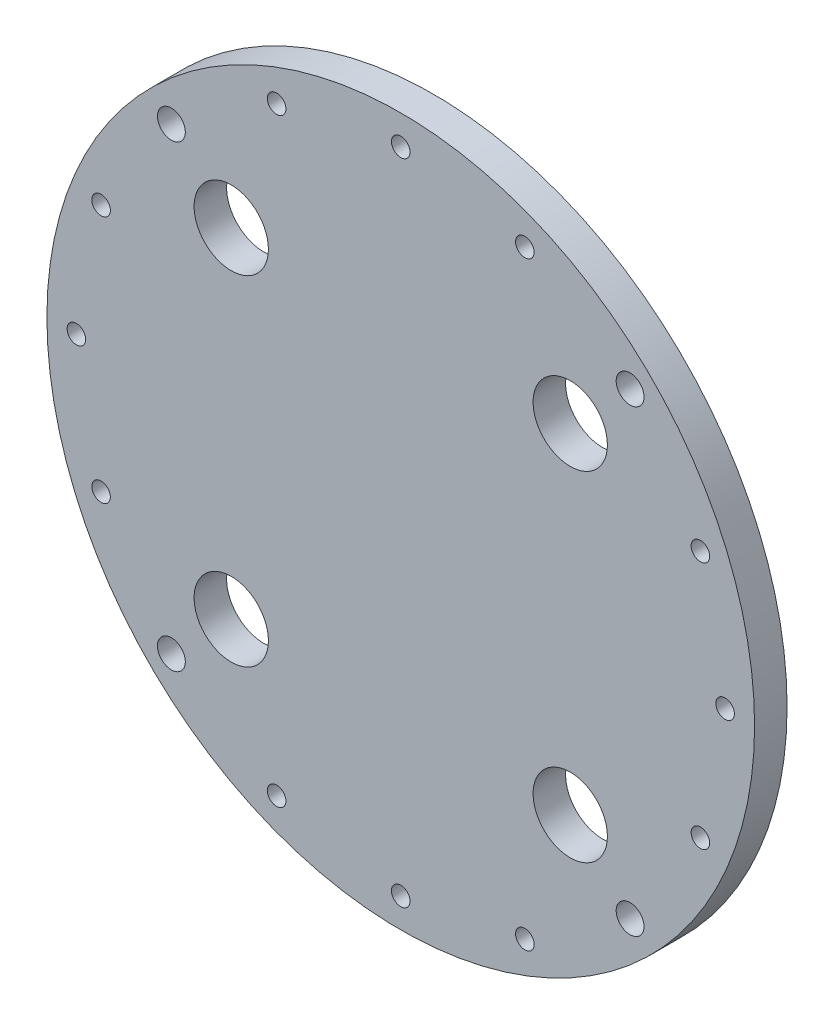
ISO-10303-21;
HEADER;
FILE_DESCRIPTION(('STEP AP214'),'2;1');
FILE_NAME('part.step','',(''),(''),'','','');
FILE_SCHEMA(('AUTOMOTIVE_DESIGN { 1 0 10303 214 1 1 1 1 }'));
ENDSEC;
DATA;
#1=APPLICATION_CONTEXT('core data for automotive mechanical design processes');
#2=APPLICATION_PROTOCOL_DEFINITION('international standard','automotive_design',2000,#1);
#3=PRODUCT_CONTEXT('',#1,'mechanical');
#4=PRODUCT('Part','Part','',(#3));
#5=PRODUCT_RELATED_PRODUCT_CATEGORY('part','',(#4));
#6=PRODUCT_DEFINITION_FORMATION('','',#4);
#7=PRODUCT_DEFINITION_CONTEXT('part definition',#1,'design');
#8=PRODUCT_DEFINITION('design','',#6,#7);
#9=PRODUCT_DEFINITION_SHAPE('','',#8);
#10=(LENGTH_UNIT() NAMED_UNIT(*) SI_UNIT(.MILLI.,.METRE.));
#11=(NAMED_UNIT(*) PLANE_ANGLE_UNIT() SI_UNIT($,.RADIAN.));
#12=(NAMED_UNIT(*) SI_UNIT($,.STERADIAN.) SOLID_ANGLE_UNIT());
#13=UNCERTAINTY_MEASURE_WITH_UNIT(LENGTH_MEASURE(1.E-05),#10,'distance_accuracy_value','');
#14=(GEOMETRIC_REPRESENTATION_CONTEXT(3) GLOBAL_UNCERTAINTY_ASSIGNED_CONTEXT((#13)) GLOBAL_UNIT_ASSIGNED_CONTEXT((#10,
#11,#12)) REPRESENTATION_CONTEXT('',''));
#15=CARTESIAN_POINT('',(0.,0.,0.));
#16=DIRECTION('',(0.,0.,1.));
#17=DIRECTION('',(1.,0.,0.));
#18=AXIS2_PLACEMENT_3D('',#15,#16,#17);
#19=CARTESIAN_POINT('',(0.,0.,28.225));
#20=DIRECTION('',(0.,0.,-1.));
#21=DIRECTION('',(-1.,0.,0.));
#22=AXIS2_PLACEMENT_3D('',#19,#20,#21);
#23=CYLINDRICAL_SURFACE('',#22,76.2);
#24=CARTESIAN_POINT('',(0.,0.,0.));
#25=DIRECTION('',(0.,0.,1.));
#26=DIRECTION('',(1.,0.,0.));
#27=AXIS2_PLACEMENT_3D('',#24,#25,#26);
#28=CIRCLE('',#27,76.2);
#29=CARTESIAN_POINT('',(76.2,0.,0.));
#30=VERTEX_POINT('',#29);
#31=EDGE_CURVE('E10',#30,#30,#28,.T.);
#32=ORIENTED_EDGE('',*,*,#31,.T.);
#33=EDGE_LOOP('',(#32));
#34=FACE_BOUND('',#33,.T.);
#35=CARTESIAN_POINT('',(0.,0.,7.));
#36=DIRECTION('',(0.,0.,1.));
#37=DIRECTION('',(1.,0.,0.));
#38=AXIS2_PLACEMENT_3D('',#35,#36,#37);
#39=CIRCLE('',#38,76.2);
#40=CARTESIAN_POINT('',(76.2,0.,7.));
#41=VERTEX_POINT('',#40);
#42=EDGE_CURVE('E59',#41,#41,#39,.T.);
#43=ORIENTED_EDGE('',*,*,#42,.F.);
#44=EDGE_LOOP('',(#43));
#45=FACE_BOUND('',#44,.T.);
#46=ADVANCED_FACE('F32',(#34,#45),#23,.T.);
#47=CARTESIAN_POINT('',(-49.3914086658801,49.3914086658806,0.));
#48=DIRECTION('',(0.,0.,1.));
#49=DIRECTION('',(1.,0.,0.));
#50=AXIS2_PLACEMENT_3D('',#47,#48,#49);
#51=CYLINDRICAL_SURFACE('',#50,3.);
#52=CARTESIAN_POINT('',(-49.3914086658801,49.3914086658806,0.));
#53=DIRECTION('',(0.,0.,1.));
#54=DIRECTION('',(1.,0.,0.));
#55=AXIS2_PLACEMENT_3D('',#52,#53,#54);
#56=CIRCLE('',#55,3.);
#57=CARTESIAN_POINT('',(-46.3914086658801,49.3914086658806,0.));
#58=VERTEX_POINT('',#57);
#59=EDGE_CURVE('E39',#58,#58,#56,.T.);
#60=ORIENTED_EDGE('',*,*,#59,.F.);
#61=EDGE_LOOP('',(#60));
#62=FACE_BOUND('',#61,.T.);
#63=CARTESIAN_POINT('',(-49.3914086658801,49.3914086658806,7.));
#64=DIRECTION('',(0.,0.,1.));
#65=DIRECTION('',(1.,0.,0.));
#66=AXIS2_PLACEMENT_3D('',#63,#64,#65);
#67=CIRCLE('',#66,3.);
#68=CARTESIAN_POINT('',(-46.3914086658801,49.3914086658806,7.));
#69=VERTEX_POINT('',#68);
#70=EDGE_CURVE('E69',#69,#69,#67,.F.);
#71=ORIENTED_EDGE('',*,*,#70,.F.);
#72=EDGE_LOOP('',(#71));
#73=FACE_BOUND('',#72,.T.);
#74=ADVANCED_FACE('F210',(#62,#73),#51,.F.);
#75=CARTESIAN_POINT('',(49.3914086658806,49.3914086658829,0.));
#76=DIRECTION('',(0.,0.,1.));
#77=DIRECTION('',(1.,0.,0.));
#78=AXIS2_PLACEMENT_3D('',#75,#76,#77);
#79=CYLINDRICAL_SURFACE('',#78,3.00000000000287);
#80=CARTESIAN_POINT('',(49.3914086658806,49.3914086658829,0.));
#81=DIRECTION('',(0.,0.,1.));
#82=DIRECTION('',(1.,0.,0.));
#83=AXIS2_PLACEMENT_3D('',#80,#81,#82);
#84=CIRCLE('',#83,3.00000000000287);
#85=CARTESIAN_POINT('',(52.3914086658835,49.3914086658829,0.));
#86=VERTEX_POINT('',#85);
#87=EDGE_CURVE('E43',#86,#86,#84,.T.);
#88=ORIENTED_EDGE('',*,*,#87,.F.);
#89=EDGE_LOOP('',(#88));
#90=FACE_BOUND('',#89,.T.);
#91=CARTESIAN_POINT('',(49.3914086658806,49.3914086658829,7.));
#92=DIRECTION('',(0.,0.,1.));
#93=DIRECTION('',(1.,0.,0.));
#94=AXIS2_PLACEMENT_3D('',#91,#92,#93);
#95=CIRCLE('',#94,3.00000000000287);
#96=CARTESIAN_POINT('',(52.3914086658835,49.3914086658829,7.));
#97=VERTEX_POINT('',#96);
#98=EDGE_CURVE('E72',#97,#97,#95,.F.);
#99=ORIENTED_EDGE('',*,*,#98,.F.);
#100=EDGE_LOOP('',(#99));
#101=FACE_BOUND('',#100,.T.);
#102=ADVANCED_FACE('F214',(#90,#101),#79,.F.);
#103=CARTESIAN_POINT('',(49.3914086658829,-49.3914086658779,0.));
#104=DIRECTION('',(0.,0.,1.));
#105=DIRECTION('',(1.,0.,0.));
#106=AXIS2_PLACEMENT_3D('',#103,#104,#105);
#107=CYLINDRICAL_SURFACE('',#106,3.00000000000392);
#108=CARTESIAN_POINT('',(49.3914086658829,-49.3914086658779,0.));
#109=DIRECTION('',(0.,0.,1.));
#110=DIRECTION('',(1.,0.,0.));
#111=AXIS2_PLACEMENT_3D('',#108,#109,#110);
#112=CIRCLE('',#111,3.00000000000392);
#113=CARTESIAN_POINT('',(52.3914086658868,-49.3914086658779,0.));
#114=VERTEX_POINT('',#113);
#115=EDGE_CURVE('E49',#114,#114,#112,.T.);
#116=ORIENTED_EDGE('',*,*,#115,.F.);
#117=EDGE_LOOP('',(#116));
#118=FACE_BOUND('',#117,.T.);
#119=CARTESIAN_POINT('',(49.3914086658829,-49.3914086658779,7.));
#120=DIRECTION('',(0.,0.,1.));
#121=DIRECTION('',(1.,0.,0.));
#122=AXIS2_PLACEMENT_3D('',#119,#120,#121);
#123=CIRCLE('',#122,3.00000000000392);
#124=CARTESIAN_POINT('',(52.3914086658868,-49.3914086658779,7.));
#125=VERTEX_POINT('',#124);
#126=EDGE_CURVE('E75',#125,#125,#123,.F.);
#127=ORIENTED_EDGE('',*,*,#126,.F.);
#128=EDGE_LOOP('',(#127));
#129=FACE_BOUND('',#128,.T.);
#130=ADVANCED_FACE('F220',(#118,#129),#107,.F.);
#131=CARTESIAN_POINT('',(-49.3914086658778,-49.3914086658801,0.));
#132=DIRECTION('',(0.,0.,1.));
#133=DIRECTION('',(1.,0.,0.));
#134=AXIS2_PLACEMENT_3D('',#131,#132,#133);
#135=CYLINDRICAL_SURFACE('',#134,3.0000000000015);
#136=CARTESIAN_POINT('',(-49.3914086658778,-49.3914086658801,0.));
#137=DIRECTION('',(0.,0.,1.));
#138=DIRECTION('',(1.,0.,0.));
#139=AXIS2_PLACEMENT_3D('',#136,#137,#138);
#140=CIRCLE('',#139,3.0000000000015);
#141=CARTESIAN_POINT('',(-46.3914086658763,-49.3914086658801,0.));
#142=VERTEX_POINT('',#141);
#143=EDGE_CURVE('E46',#142,#142,#140,.T.);
#144=ORIENTED_EDGE('',*,*,#143,.F.);
#145=EDGE_LOOP('',(#144));
#146=FACE_BOUND('',#145,.T.);
#147=CARTESIAN_POINT('',(-49.3914086658778,-49.3914086658801,7.));
#148=DIRECTION('',(0.,0.,1.));
#149=DIRECTION('',(1.,0.,0.));
#150=AXIS2_PLACEMENT_3D('',#147,#148,#149);
#151=CIRCLE('',#150,3.0000000000015);
#152=CARTESIAN_POINT('',(-46.3914086658763,-49.3914086658801,7.));
#153=VERTEX_POINT('',#152);
#154=EDGE_CURVE('E78',#153,#153,#151,.F.);
#155=ORIENTED_EDGE('',*,*,#154,.F.);
#156=EDGE_LOOP('',(#155));
#157=FACE_BOUND('',#156,.T.);
#158=ADVANCED_FACE('F226',(#146,#157),#135,.F.);
#159=CARTESIAN_POINT('',(69.849999999998,-1.9809793247677E-12,11.));
#160=DIRECTION('',(0.,0.,-1.));
#161=DIRECTION('',(-1.,0.,0.));
#162=AXIS2_PLACEMENT_3D('',#159,#160,#161);
#163=CYLINDRICAL_SURFACE('',#162,2.00000000000318);
#164=CARTESIAN_POINT('',(69.849999999998,-1.9809793247677E-12,0.));
#165=DIRECTION('',(0.,0.,-1.));
#166=DIRECTION('',(-1.,0.,0.));
#167=AXIS2_PLACEMENT_3D('',#164,#165,#166);
#168=CIRCLE('',#167,2.00000000000318);
#169=CARTESIAN_POINT('',(67.8499999999948,-1.9809793247677E-12,0.));
#170=VERTEX_POINT('',#169);
#171=EDGE_CURVE('E55',#170,#170,#168,.T.);
#172=ORIENTED_EDGE('',*,*,#171,.T.);
#173=EDGE_LOOP('',(#172));
#174=FACE_BOUND('',#173,.T.);
#175=CARTESIAN_POINT('',(69.849999999998,-1.9809793247677E-12,7.));
#176=DIRECTION('',(0.,0.,1.));
#177=DIRECTION('',(1.,0.,0.));
#178=AXIS2_PLACEMENT_3D('',#175,#176,#177);
#179=CIRCLE('',#178,2.00000000000318);
#180=CARTESIAN_POINT('',(71.8500000000012,-1.9809793247677E-12,7.));
#181=VERTEX_POINT('',#180);
#182=EDGE_CURVE('E81',#181,#181,#179,.F.);
#183=ORIENTED_EDGE('',*,*,#182,.F.);
#184=EDGE_LOOP('',(#183));
#185=FACE_BOUND('',#184,.T.);
#186=ADVANCED_FACE('F283',(#174,#185),#163,.F.);
#187=CARTESIAN_POINT('',(-3.94562798446877E-12,-69.85,11.));
#188=DIRECTION('',(0.,0.,-1.));
#189=DIRECTION('',(-1.,0.,0.));
#190=AXIS2_PLACEMENT_3D('',#187,#188,#189);
#191=CYLINDRICAL_SURFACE('',#190,2.00000000000424);
#192=CARTESIAN_POINT('',(-3.94562798446877E-12,-69.85,0.));
#193=DIRECTION('',(0.,0.,-1.));
#194=DIRECTION('',(-1.,0.,0.));
#195=AXIS2_PLACEMENT_3D('',#192,#193,#194);
#196=CIRCLE('',#195,2.00000000000424);
#197=CARTESIAN_POINT('',(-2.00000000000819,-69.85,0.));
#198=VERTEX_POINT('',#197);
#199=EDGE_CURVE('E58',#198,#198,#196,.T.);
#200=ORIENTED_EDGE('',*,*,#199,.T.);
#201=EDGE_LOOP('',(#200));
#202=FACE_BOUND('',#201,.T.);
#203=CARTESIAN_POINT('',(-3.94562798446877E-12,-69.85,7.));
#204=DIRECTION('',(0.,0.,1.));
#205=DIRECTION('',(1.,0.,0.));
#206=AXIS2_PLACEMENT_3D('',#203,#204,#205);
#207=CIRCLE('',#206,2.00000000000424);
#208=CARTESIAN_POINT('',(2.0000000000003,-69.85,7.));
#209=VERTEX_POINT('',#208);
#210=EDGE_CURVE('E84',#209,#209,#207,.F.);
#211=ORIENTED_EDGE('',*,*,#210,.F.);
#212=EDGE_LOOP('',(#211));
#213=FACE_BOUND('',#212,.T.);
#214=ADVANCED_FACE('F288',(#202,#213),#191,.F.);
#215=CARTESIAN_POINT('',(-69.850000000002,1.97242516687565E-12,11.));
#216=DIRECTION('',(0.,0.,-1.));
#217=DIRECTION('',(-1.,0.,0.));
#218=AXIS2_PLACEMENT_3D('',#215,#216,#217);
#219=CYLINDRICAL_SURFACE('',#218,2.00000000000154);
#220=CARTESIAN_POINT('',(-69.850000000002,1.97242516687565E-12,0.));
#221=DIRECTION('',(0.,0.,-1.));
#222=DIRECTION('',(-1.,0.,0.));
#223=AXIS2_PLACEMENT_3D('',#220,#221,#222);
#224=CIRCLE('',#223,2.00000000000154);
#225=CARTESIAN_POINT('',(-71.8500000000035,1.97242516687565E-12,0.));
#226=VERTEX_POINT('',#225);
#227=EDGE_CURVE('E62',#226,#226,#224,.T.);
#228=ORIENTED_EDGE('',*,*,#227,.T.);
#229=EDGE_LOOP('',(#228));
#230=FACE_BOUND('',#229,.T.);
#231=CARTESIAN_POINT('',(-69.850000000002,1.97242516687565E-12,7.));
#232=DIRECTION('',(0.,0.,1.));
#233=DIRECTION('',(1.,0.,0.));
#234=AXIS2_PLACEMENT_3D('',#231,#232,#233);
#235=CIRCLE('',#234,2.00000000000154);
#236=CARTESIAN_POINT('',(-67.8500000000004,1.97242516687565E-12,7.));
#237=VERTEX_POINT('',#236);
#238=EDGE_CURVE('E87',#237,#237,#235,.F.);
#239=ORIENTED_EDGE('',*,*,#238,.F.);
#240=EDGE_LOOP('',(#239));
#241=FACE_BOUND('',#240,.T.);
#242=ADVANCED_FACE('F234',(#230,#241),#219,.F.);
#243=CARTESIAN_POINT('',(0.,69.85,11.));
#244=DIRECTION('',(0.,0.,-1.));
#245=DIRECTION('',(-1.,0.,0.));
#246=AXIS2_PLACEMENT_3D('',#243,#244,#245);
#247=CYLINDRICAL_SURFACE('',#246,2.);
#248=CARTESIAN_POINT('',(0.,69.85,0.));
#249=DIRECTION('',(0.,0.,-1.));
#250=DIRECTION('',(-1.,0.,0.));
#251=AXIS2_PLACEMENT_3D('',#248,#249,#250);
#252=CIRCLE('',#251,2.);
#253=CARTESIAN_POINT('',(-2.,69.85,0.));
#254=VERTEX_POINT('',#253);
#255=EDGE_CURVE('E50',#254,#254,#252,.T.);
#256=ORIENTED_EDGE('',*,*,#255,.T.);
#257=EDGE_LOOP('',(#256));
#258=FACE_BOUND('',#257,.T.);
#259=CARTESIAN_POINT('',(0.,69.85,7.));
#260=DIRECTION('',(0.,0.,1.));
#261=DIRECTION('',(1.,0.,0.));
#262=AXIS2_PLACEMENT_3D('',#259,#260,#261);
#263=CIRCLE('',#262,2.);
#264=CARTESIAN_POINT('',(2.,69.85,7.));
#265=VERTEX_POINT('',#264);
#266=EDGE_CURVE('E35',#265,#265,#263,.F.);
#267=ORIENTED_EDGE('',*,*,#266,.F.);
#268=EDGE_LOOP('',(#267));
#269=FACE_BOUND('',#268,.T.);
#270=ADVANCED_FACE('F229',(#258,#269),#247,.F.);
#271=CARTESIAN_POINT('',(0.,0.,0.));
#272=DIRECTION('',(0.,0.,1.));
#273=DIRECTION('',(1.,0.,0.));
#274=AXIS2_PLACEMENT_3D('',#271,#272,#273);
#275=PLANE('',#274);
#276=CARTESIAN_POINT('',(36.5,36.5,0.));
#277=DIRECTION('',(0.,0.,1.));
#278=DIRECTION('',(1.,0.,0.));
#279=AXIS2_PLACEMENT_3D('',#276,#277,#278);
#280=CIRCLE('',#279,8.);
#281=CARTESIAN_POINT('',(44.5,36.5,0.));
#282=VERTEX_POINT('',#281);
#283=EDGE_CURVE('E144',#282,#282,#280,.F.);
#284=ORIENTED_EDGE('',*,*,#283,.F.);
#285=EDGE_LOOP('',(#284));
#286=FACE_BOUND('',#285,.T.);
#287=CARTESIAN_POINT('',(-36.5,-36.5,0.));
#288=DIRECTION('',(0.,0.,1.));
#289=DIRECTION('',(1.,0.,0.));
#290=AXIS2_PLACEMENT_3D('',#287,#288,#289);
#291=CIRCLE('',#290,8.);
#292=CARTESIAN_POINT('',(-28.5,-36.5,0.));
#293=VERTEX_POINT('',#292);
#294=EDGE_CURVE('E145',#293,#293,#291,.F.);
#295=ORIENTED_EDGE('',*,*,#294,.F.);
#296=EDGE_LOOP('',(#295));
#297=FACE_BOUND('',#296,.T.);
#298=CARTESIAN_POINT('',(36.5,-36.5,0.));
#299=DIRECTION('',(0.,0.,1.));
#300=DIRECTION('',(1.,0.,0.));
#301=AXIS2_PLACEMENT_3D('',#298,#299,#300);
#302=CIRCLE('',#301,8.);
#303=CARTESIAN_POINT('',(44.5,-36.5,0.));
#304=VERTEX_POINT('',#303);
#305=EDGE_CURVE('E152',#304,#304,#302,.F.);
#306=ORIENTED_EDGE('',*,*,#305,.F.);
#307=EDGE_LOOP('',(#306));
#308=FACE_BOUND('',#307,.T.);
#309=CARTESIAN_POINT('',(-36.5,36.5,0.));
#310=DIRECTION('',(0.,0.,1.));
#311=DIRECTION('',(1.,0.,0.));
#312=AXIS2_PLACEMENT_3D('',#309,#310,#311);
#313=CIRCLE('',#312,8.);
#314=CARTESIAN_POINT('',(-28.5,36.5,0.));
#315=VERTEX_POINT('',#314);
#316=EDGE_CURVE('E136',#315,#315,#313,.F.);
#317=ORIENTED_EDGE('',*,*,#316,.F.);
#318=EDGE_LOOP('',(#317));
#319=FACE_BOUND('',#318,.T.);
#320=CARTESIAN_POINT('',(64.5329853459183,-26.730437750695,0.));
#321=DIRECTION('',(0.,0.,1.));
#322=DIRECTION('',(1.,0.,0.));
#323=AXIS2_PLACEMENT_3D('',#320,#321,#322);
#324=CIRCLE('',#323,2.00000000000702);
#325=CARTESIAN_POINT('',(66.5329853459253,-26.730437750695,0.));
#326=VERTEX_POINT('',#325);
#327=EDGE_CURVE('E112',#326,#326,#324,.T.);
#328=ORIENTED_EDGE('',*,*,#327,.T.);
#329=EDGE_LOOP('',(#328));
#330=FACE_BOUND('',#329,.T.);
#331=CARTESIAN_POINT('',(-26.7304377507044,64.5329853459204,0.));
#332=DIRECTION('',(0.,0.,1.));
#333=DIRECTION('',(1.,0.,0.));
#334=AXIS2_PLACEMENT_3D('',#331,#332,#333);
#335=CIRCLE('',#334,2.00000000000714);
#336=CARTESIAN_POINT('',(-24.7304377506973,64.5329853459204,0.));
#337=VERTEX_POINT('',#336);
#338=EDGE_CURVE('E101',#337,#337,#335,.T.);
#339=ORIENTED_EDGE('',*,*,#338,.T.);
#340=EDGE_LOOP('',(#339));
#341=FACE_BOUND('',#340,.T.);
#342=CARTESIAN_POINT('',(26.7304377507002,64.5329853459204,0.));
#343=DIRECTION('',(0.,0.,1.));
#344=DIRECTION('',(1.,0.,0.));
#345=AXIS2_PLACEMENT_3D('',#342,#343,#344);
#346=CIRCLE('',#345,2.00000000000734);
#347=CARTESIAN_POINT('',(28.7304377507076,64.5329853459204,0.));
#348=VERTEX_POINT('',#347);
#349=EDGE_CURVE('E100',#348,#348,#346,.T.);
#350=ORIENTED_EDGE('',*,*,#349,.T.);
#351=EDGE_LOOP('',(#350));
#352=FACE_BOUND('',#351,.T.);
#353=CARTESIAN_POINT('',(-64.5329853459152,-26.7304377507023,0.));
#354=DIRECTION('',(0.,0.,1.));
#355=DIRECTION('',(1.,0.,0.));
#356=AXIS2_PLACEMENT_3D('',#353,#354,#355);
#357=CIRCLE('',#356,2.00000000000155);
#358=CARTESIAN_POINT('',(-62.5329853459136,-26.7304377507023,0.));
#359=VERTEX_POINT('',#358);
#360=EDGE_CURVE('E94',#359,#359,#357,.T.);
#361=ORIENTED_EDGE('',*,*,#360,.T.);
#362=EDGE_LOOP('',(#361));
#363=FACE_BOUND('',#362,.T.);
#364=CARTESIAN_POINT('',(26.7304377507076,-64.5329853459131,0.));
#365=DIRECTION('',(0.,0.,1.));
#366=DIRECTION('',(1.,0.,0.));
#367=AXIS2_PLACEMENT_3D('',#364,#365,#366);
#368=CIRCLE('',#367,2.00000000000098);
#369=CARTESIAN_POINT('',(28.7304377507085,-64.5329853459131,0.));
#370=VERTEX_POINT('',#369);
#371=EDGE_CURVE('E125',#370,#370,#368,.T.);
#372=ORIENTED_EDGE('',*,*,#371,.T.);
#373=EDGE_LOOP('',(#372));
#374=FACE_BOUND('',#373,.T.);
#375=CARTESIAN_POINT('',(-26.7304377506971,-64.5329853459131,0.));
#376=DIRECTION('',(0.,0.,1.));
#377=DIRECTION('',(1.,0.,0.));
#378=AXIS2_PLACEMENT_3D('',#375,#376,#377);
#379=CIRCLE('',#378,2.00000000000154);
#380=CARTESIAN_POINT('',(-24.7304377506956,-64.5329853459131,0.));
#381=VERTEX_POINT('',#380);
#382=EDGE_CURVE('E124',#381,#381,#379,.T.);
#383=ORIENTED_EDGE('',*,*,#382,.T.);
#384=EDGE_LOOP('',(#383));
#385=FACE_BOUND('',#384,.T.);
#386=CARTESIAN_POINT('',(64.5329853459183,26.7304377507097,0.));
#387=DIRECTION('',(0.,0.,1.));
#388=DIRECTION('',(1.,0.,0.));
#389=AXIS2_PLACEMENT_3D('',#386,#387,#388);
#390=CIRCLE('',#389,2.00000000000665);
#391=CARTESIAN_POINT('',(66.5329853459249,26.7304377507097,0.));
#392=VERTEX_POINT('',#391);
#393=EDGE_CURVE('E113',#392,#392,#390,.T.);
#394=ORIENTED_EDGE('',*,*,#393,.T.);
#395=EDGE_LOOP('',(#394));
#396=FACE_BOUND('',#395,.T.);
#397=CARTESIAN_POINT('',(-64.5329853459152,26.7304377507023,0.));
#398=DIRECTION('',(0.,0.,1.));
#399=DIRECTION('',(1.,0.,0.));
#400=AXIS2_PLACEMENT_3D('',#397,#398,#399);
#401=CIRCLE('',#400,2.00000000000155);
#402=CARTESIAN_POINT('',(-62.5329853459136,26.7304377507023,0.));
#403=VERTEX_POINT('',#402);
#404=EDGE_CURVE('E93',#403,#403,#401,.T.);
#405=ORIENTED_EDGE('',*,*,#404,.T.);
#406=EDGE_LOOP('',(#405));
#407=FACE_BOUND('',#406,.T.);
#408=ORIENTED_EDGE('',*,*,#255,.F.);
#409=EDGE_LOOP('',(#408));
#410=FACE_BOUND('',#409,.T.);
#411=ORIENTED_EDGE('',*,*,#227,.F.);
#412=EDGE_LOOP('',(#411));
#413=FACE_BOUND('',#412,.T.);
#414=ORIENTED_EDGE('',*,*,#199,.F.);
#415=EDGE_LOOP('',(#414));
#416=FACE_BOUND('',#415,.T.);
#417=ORIENTED_EDGE('',*,*,#171,.F.);
#418=EDGE_LOOP('',(#417));
#419=FACE_BOUND('',#418,.T.);
#420=ORIENTED_EDGE('',*,*,#143,.T.);
#421=EDGE_LOOP('',(#420));
#422=FACE_BOUND('',#421,.T.);
#423=ORIENTED_EDGE('',*,*,#115,.T.);
#424=EDGE_LOOP('',(#423));
#425=FACE_BOUND('',#424,.T.);
#426=ORIENTED_EDGE('',*,*,#87,.T.);
#427=EDGE_LOOP('',(#426));
#428=FACE_BOUND('',#427,.T.);
#429=ORIENTED_EDGE('',*,*,#59,.T.);
#430=EDGE_LOOP('',(#429));
#431=FACE_BOUND('',#430,.T.);
#432=ORIENTED_EDGE('',*,*,#31,.F.);
#433=EDGE_LOOP('',(#432));
#434=FACE_BOUND('',#433,.T.);
#435=ADVANCED_FACE('F169',(#286,#297,#308,#319,#330,#341,#352,#363,#374,#385,#396,#407,#410,
#413,#416,#419,#422,#425,#428,#431,#434),#275,.F.);
#436=CARTESIAN_POINT('',(0.,0.,7.));
#437=DIRECTION('',(0.,0.,1.));
#438=DIRECTION('',(1.,0.,0.));
#439=AXIS2_PLACEMENT_3D('',#436,#437,#438);
#440=PLANE('',#439);
#441=CARTESIAN_POINT('',(36.5,36.5,7.));
#442=DIRECTION('',(0.,0.,1.));
#443=DIRECTION('',(1.,0.,0.));
#444=AXIS2_PLACEMENT_3D('',#441,#442,#443);
#445=CIRCLE('',#444,8.);
#446=CARTESIAN_POINT('',(44.5,36.5,7.));
#447=VERTEX_POINT('',#446);
#448=EDGE_CURVE('E148',#447,#447,#445,.T.);
#449=ORIENTED_EDGE('',*,*,#448,.F.);
#450=EDGE_LOOP('',(#449));
#451=FACE_BOUND('',#450,.T.);
#452=CARTESIAN_POINT('',(-36.5,-36.5,7.));
#453=DIRECTION('',(0.,0.,1.));
#454=DIRECTION('',(1.,0.,0.));
#455=AXIS2_PLACEMENT_3D('',#452,#453,#454);
#456=CIRCLE('',#455,8.);
#457=CARTESIAN_POINT('',(-28.5,-36.5,7.));
#458=VERTEX_POINT('',#457);
#459=EDGE_CURVE('E149',#458,#458,#456,.T.);
#460=ORIENTED_EDGE('',*,*,#459,.F.);
#461=EDGE_LOOP('',(#460));
#462=FACE_BOUND('',#461,.T.);
#463=CARTESIAN_POINT('',(36.5,-36.5,7.));
#464=DIRECTION('',(0.,0.,1.));
#465=DIRECTION('',(1.,0.,0.));
#466=AXIS2_PLACEMENT_3D('',#463,#464,#465);
#467=CIRCLE('',#466,8.);
#468=CARTESIAN_POINT('',(44.5,-36.5,7.));
#469=VERTEX_POINT('',#468);
#470=EDGE_CURVE('E159',#469,#469,#467,.T.);
#471=ORIENTED_EDGE('',*,*,#470,.F.);
#472=EDGE_LOOP('',(#471));
#473=FACE_BOUND('',#472,.T.);
#474=CARTESIAN_POINT('',(-36.5,36.5,7.));
#475=DIRECTION('',(0.,0.,1.));
#476=DIRECTION('',(1.,0.,0.));
#477=AXIS2_PLACEMENT_3D('',#474,#475,#476);
#478=CIRCLE('',#477,8.);
#479=CARTESIAN_POINT('',(-28.5,36.5,7.));
#480=VERTEX_POINT('',#479);
#481=EDGE_CURVE('E141',#480,#480,#478,.T.);
#482=ORIENTED_EDGE('',*,*,#481,.F.);
#483=EDGE_LOOP('',(#482));
#484=FACE_BOUND('',#483,.T.);
#485=CARTESIAN_POINT('',(64.5329853459183,-26.730437750695,7.));
#486=DIRECTION('',(0.,0.,1.));
#487=DIRECTION('',(1.,0.,0.));
#488=AXIS2_PLACEMENT_3D('',#485,#486,#487);
#489=CIRCLE('',#488,2.00000000000702);
#490=CARTESIAN_POINT('',(66.5329853459253,-26.730437750695,7.));
#491=VERTEX_POINT('',#490);
#492=EDGE_CURVE('E109',#491,#491,#489,.T.);
#493=ORIENTED_EDGE('',*,*,#492,.F.);
#494=EDGE_LOOP('',(#493));
#495=FACE_BOUND('',#494,.T.);
#496=CARTESIAN_POINT('',(-26.7304377507044,64.5329853459204,7.));
#497=DIRECTION('',(0.,0.,1.));
#498=DIRECTION('',(1.,0.,0.));
#499=AXIS2_PLACEMENT_3D('',#496,#497,#498);
#500=CIRCLE('',#499,2.00000000000714);
#501=CARTESIAN_POINT('',(-24.7304377506973,64.5329853459204,7.));
#502=VERTEX_POINT('',#501);
#503=EDGE_CURVE('E116',#502,#502,#500,.T.);
#504=ORIENTED_EDGE('',*,*,#503,.F.);
#505=EDGE_LOOP('',(#504));
#506=FACE_BOUND('',#505,.T.);
#507=CARTESIAN_POINT('',(26.7304377507002,64.5329853459204,7.));
#508=DIRECTION('',(0.,0.,1.));
#509=DIRECTION('',(1.,0.,0.));
#510=AXIS2_PLACEMENT_3D('',#507,#508,#509);
#511=CIRCLE('',#510,2.00000000000734);
#512=CARTESIAN_POINT('',(28.7304377507076,64.5329853459204,7.));
#513=VERTEX_POINT('',#512);
#514=EDGE_CURVE('E97',#513,#513,#511,.T.);
#515=ORIENTED_EDGE('',*,*,#514,.F.);
#516=EDGE_LOOP('',(#515));
#517=FACE_BOUND('',#516,.T.);
#518=CARTESIAN_POINT('',(-64.5329853459152,-26.7304377507023,7.));
#519=DIRECTION('',(0.,0.,1.));
#520=DIRECTION('',(1.,0.,0.));
#521=AXIS2_PLACEMENT_3D('',#518,#519,#520);
#522=CIRCLE('',#521,2.00000000000155);
#523=CARTESIAN_POINT('',(-62.5329853459136,-26.7304377507023,7.));
#524=VERTEX_POINT('',#523);
#525=EDGE_CURVE('E104',#524,#524,#522,.T.);
#526=ORIENTED_EDGE('',*,*,#525,.F.);
#527=EDGE_LOOP('',(#526));
#528=FACE_BOUND('',#527,.T.);
#529=CARTESIAN_POINT('',(26.7304377507076,-64.5329853459131,7.));
#530=DIRECTION('',(0.,0.,1.));
#531=DIRECTION('',(1.,0.,0.));
#532=AXIS2_PLACEMENT_3D('',#529,#530,#531);
#533=CIRCLE('',#532,2.00000000000098);
#534=CARTESIAN_POINT('',(28.7304377507085,-64.5329853459131,7.));
#535=VERTEX_POINT('',#534);
#536=EDGE_CURVE('E133',#535,#535,#533,.T.);
#537=ORIENTED_EDGE('',*,*,#536,.F.);
#538=EDGE_LOOP('',(#537));
#539=FACE_BOUND('',#538,.T.);
#540=CARTESIAN_POINT('',(-26.7304377506971,-64.5329853459131,7.));
#541=DIRECTION('',(0.,0.,1.));
#542=DIRECTION('',(1.,0.,0.));
#543=AXIS2_PLACEMENT_3D('',#540,#541,#542);
#544=CIRCLE('',#543,2.00000000000154);
#545=CARTESIAN_POINT('',(-24.7304377506956,-64.5329853459131,7.));
#546=VERTEX_POINT('',#545);
#547=EDGE_CURVE('E121',#546,#546,#544,.T.);
#548=ORIENTED_EDGE('',*,*,#547,.F.);
#549=EDGE_LOOP('',(#548));
#550=FACE_BOUND('',#549,.T.);
#551=CARTESIAN_POINT('',(64.5329853459183,26.7304377507097,7.));
#552=DIRECTION('',(0.,0.,1.));
#553=DIRECTION('',(1.,0.,0.));
#554=AXIS2_PLACEMENT_3D('',#551,#552,#553);
#555=CIRCLE('',#554,2.00000000000665);
#556=CARTESIAN_POINT('',(66.5329853459249,26.7304377507097,7.));
#557=VERTEX_POINT('',#556);
#558=EDGE_CURVE('E128',#557,#557,#555,.T.);
#559=ORIENTED_EDGE('',*,*,#558,.F.);
#560=EDGE_LOOP('',(#559));
#561=FACE_BOUND('',#560,.T.);
#562=CARTESIAN_POINT('',(-64.5329853459152,26.7304377507023,7.));
#563=DIRECTION('',(0.,0.,1.));
#564=DIRECTION('',(1.,0.,0.));
#565=AXIS2_PLACEMENT_3D('',#562,#563,#564);
#566=CIRCLE('',#565,2.00000000000155);
#567=CARTESIAN_POINT('',(-62.5329853459136,26.7304377507023,7.));
#568=VERTEX_POINT('',#567);
#569=EDGE_CURVE('E90',#568,#568,#566,.T.);
#570=ORIENTED_EDGE('',*,*,#569,.F.);
#571=EDGE_LOOP('',(#570));
#572=FACE_BOUND('',#571,.T.);
#573=ORIENTED_EDGE('',*,*,#70,.T.);
#574=EDGE_LOOP('',(#573));
#575=FACE_BOUND('',#574,.T.);
#576=ORIENTED_EDGE('',*,*,#98,.T.);
#577=EDGE_LOOP('',(#576));
#578=FACE_BOUND('',#577,.T.);
#579=ORIENTED_EDGE('',*,*,#126,.T.);
#580=EDGE_LOOP('',(#579));
#581=FACE_BOUND('',#580,.T.);
#582=ORIENTED_EDGE('',*,*,#154,.T.);
#583=EDGE_LOOP('',(#582));
#584=FACE_BOUND('',#583,.T.);
#585=ORIENTED_EDGE('',*,*,#182,.T.);
#586=EDGE_LOOP('',(#585));
#587=FACE_BOUND('',#586,.T.);
#588=ORIENTED_EDGE('',*,*,#210,.T.);
#589=EDGE_LOOP('',(#588));
#590=FACE_BOUND('',#589,.T.);
#591=ORIENTED_EDGE('',*,*,#238,.T.);
#592=EDGE_LOOP('',(#591));
#593=FACE_BOUND('',#592,.T.);
#594=ORIENTED_EDGE('',*,*,#266,.T.);
#595=EDGE_LOOP('',(#594));
#596=FACE_BOUND('',#595,.T.);
#597=ORIENTED_EDGE('',*,*,#42,.T.);
#598=EDGE_LOOP('',(#597));
#599=FACE_BOUND('',#598,.T.);
#600=ADVANCED_FACE('F165',(#451,#462,#473,#484,#495,#506,#517,#528,#539,#550,#561,#572,#575,
#578,#581,#584,#587,#590,#593,#596,#599),#440,.T.);
#601=CARTESIAN_POINT('',(-64.5329853459152,26.7304377507023,0.));
#602=DIRECTION('',(0.,0.,1.));
#603=DIRECTION('',(1.,0.,0.));
#604=AXIS2_PLACEMENT_3D('',#601,#602,#603);
#605=CYLINDRICAL_SURFACE('',#604,2.00000000000155);
#606=ORIENTED_EDGE('',*,*,#404,.F.);
#607=EDGE_LOOP('',(#606));
#608=FACE_BOUND('',#607,.T.);
#609=ORIENTED_EDGE('',*,*,#569,.T.);
#610=EDGE_LOOP('',(#609));
#611=FACE_BOUND('',#610,.T.);
#612=ADVANCED_FACE('F168',(#608,#611),#605,.F.);
#613=CARTESIAN_POINT('',(64.5329853459183,26.7304377507097,0.));
#614=DIRECTION('',(0.,0.,1.));
#615=DIRECTION('',(1.,0.,0.));
#616=AXIS2_PLACEMENT_3D('',#613,#614,#615);
#617=CYLINDRICAL_SURFACE('',#616,2.00000000000665);
#618=ORIENTED_EDGE('',*,*,#393,.F.);
#619=EDGE_LOOP('',(#618));
#620=FACE_BOUND('',#619,.T.);
#621=ORIENTED_EDGE('',*,*,#558,.T.);
#622=EDGE_LOOP('',(#621));
#623=FACE_BOUND('',#622,.T.);
#624=ADVANCED_FACE('F298',(#620,#623),#617,.F.);
#625=CARTESIAN_POINT('',(-26.7304377506971,-64.5329853459131,0.));
#626=DIRECTION('',(0.,0.,1.));
#627=DIRECTION('',(1.,0.,0.));
#628=AXIS2_PLACEMENT_3D('',#625,#626,#627);
#629=CYLINDRICAL_SURFACE('',#628,2.00000000000154);
#630=ORIENTED_EDGE('',*,*,#382,.F.);
#631=EDGE_LOOP('',(#630));
#632=FACE_BOUND('',#631,.T.);
#633=ORIENTED_EDGE('',*,*,#547,.T.);
#634=EDGE_LOOP('',(#633));
#635=FACE_BOUND('',#634,.T.);
#636=ADVANCED_FACE('F318',(#632,#635),#629,.F.);
#637=CARTESIAN_POINT('',(26.7304377507076,-64.5329853459131,0.));
#638=DIRECTION('',(0.,0.,1.));
#639=DIRECTION('',(1.,0.,0.));
#640=AXIS2_PLACEMENT_3D('',#637,#638,#639);
#641=CYLINDRICAL_SURFACE('',#640,2.00000000000098);
#642=ORIENTED_EDGE('',*,*,#371,.F.);
#643=EDGE_LOOP('',(#642));
#644=FACE_BOUND('',#643,.T.);
#645=ORIENTED_EDGE('',*,*,#536,.T.);
#646=EDGE_LOOP('',(#645));
#647=FACE_BOUND('',#646,.T.);
#648=ADVANCED_FACE('F308',(#644,#647),#641,.F.);
#649=CARTESIAN_POINT('',(-64.5329853459152,-26.7304377507023,0.));
#650=DIRECTION('',(0.,0.,1.));
#651=DIRECTION('',(1.,0.,0.));
#652=AXIS2_PLACEMENT_3D('',#649,#650,#651);
#653=CYLINDRICAL_SURFACE('',#652,2.00000000000155);
#654=ORIENTED_EDGE('',*,*,#360,.F.);
#655=EDGE_LOOP('',(#654));
#656=FACE_BOUND('',#655,.T.);
#657=ORIENTED_EDGE('',*,*,#525,.T.);
#658=EDGE_LOOP('',(#657));
#659=FACE_BOUND('',#658,.T.);
#660=ADVANCED_FACE('F304',(#656,#659),#653,.F.);
#661=CARTESIAN_POINT('',(26.7304377507002,64.5329853459204,0.));
#662=DIRECTION('',(0.,0.,1.));
#663=DIRECTION('',(1.,0.,0.));
#664=AXIS2_PLACEMENT_3D('',#661,#662,#663);
#665=CYLINDRICAL_SURFACE('',#664,2.00000000000734);
#666=ORIENTED_EDGE('',*,*,#349,.F.);
#667=EDGE_LOOP('',(#666));
#668=FACE_BOUND('',#667,.T.);
#669=ORIENTED_EDGE('',*,*,#514,.T.);
#670=EDGE_LOOP('',(#669));
#671=FACE_BOUND('',#670,.T.);
#672=ADVANCED_FACE('F300',(#668,#671),#665,.F.);
#673=CARTESIAN_POINT('',(-26.7304377507044,64.5329853459204,0.));
#674=DIRECTION('',(0.,0.,1.));
#675=DIRECTION('',(1.,0.,0.));
#676=AXIS2_PLACEMENT_3D('',#673,#674,#675);
#677=CYLINDRICAL_SURFACE('',#676,2.00000000000714);
#678=ORIENTED_EDGE('',*,*,#338,.F.);
#679=EDGE_LOOP('',(#678));
#680=FACE_BOUND('',#679,.T.);
#681=ORIENTED_EDGE('',*,*,#503,.T.);
#682=EDGE_LOOP('',(#681));
#683=FACE_BOUND('',#682,.T.);
#684=ADVANCED_FACE('F303',(#680,#683),#677,.F.);
#685=CARTESIAN_POINT('',(64.5329853459183,-26.730437750695,0.));
#686=DIRECTION('',(0.,0.,1.));
#687=DIRECTION('',(1.,0.,0.));
#688=AXIS2_PLACEMENT_3D('',#685,#686,#687);
#689=CYLINDRICAL_SURFACE('',#688,2.00000000000702);
#690=ORIENTED_EDGE('',*,*,#327,.F.);
#691=EDGE_LOOP('',(#690));
#692=FACE_BOUND('',#691,.T.);
#693=ORIENTED_EDGE('',*,*,#492,.T.);
#694=EDGE_LOOP('',(#693));
#695=FACE_BOUND('',#694,.T.);
#696=ADVANCED_FACE('F310',(#692,#695),#689,.F.);
#697=CARTESIAN_POINT('',(-36.5,36.5,-22.6274169979695));
#698=DIRECTION('',(0.,0.,1.));
#699=DIRECTION('',(1.,0.,0.));
#700=AXIS2_PLACEMENT_3D('',#697,#698,#699);
#701=CYLINDRICAL_SURFACE('',#700,8.);
#702=ORIENTED_EDGE('',*,*,#316,.T.);
#703=EDGE_LOOP('',(#702));
#704=FACE_BOUND('',#703,.T.);
#705=ORIENTED_EDGE('',*,*,#481,.T.);
#706=EDGE_LOOP('',(#705));
#707=FACE_BOUND('',#706,.T.);
#708=ADVANCED_FACE('F313',(#704,#707),#701,.F.);
#709=CARTESIAN_POINT('',(36.5,-36.5,-22.6274169979695));
#710=DIRECTION('',(0.,0.,1.));
#711=DIRECTION('',(1.,0.,0.));
#712=AXIS2_PLACEMENT_3D('',#709,#710,#711);
#713=CYLINDRICAL_SURFACE('',#712,8.);
#714=ORIENTED_EDGE('',*,*,#305,.T.);
#715=EDGE_LOOP('',(#714));
#716=FACE_BOUND('',#715,.T.);
#717=ORIENTED_EDGE('',*,*,#470,.T.);
#718=EDGE_LOOP('',(#717));
#719=FACE_BOUND('',#718,.T.);
#720=ADVANCED_FACE('F163',(#716,#719),#713,.F.);
#721=CARTESIAN_POINT('',(-36.5,-36.5,-22.6274169979695));
#722=DIRECTION('',(0.,0.,1.));
#723=DIRECTION('',(1.,0.,0.));
#724=AXIS2_PLACEMENT_3D('',#721,#722,#723);
#725=CYLINDRICAL_SURFACE('',#724,8.);
#726=ORIENTED_EDGE('',*,*,#294,.T.);
#727=EDGE_LOOP('',(#726));
#728=FACE_BOUND('',#727,.T.);
#729=ORIENTED_EDGE('',*,*,#459,.T.);
#730=EDGE_LOOP('',(#729));
#731=FACE_BOUND('',#730,.T.);
#732=ADVANCED_FACE('F331',(#728,#731),#725,.F.);
#733=CARTESIAN_POINT('',(36.5,36.5,-22.6274169979695));
#734=DIRECTION('',(0.,0.,1.));
#735=DIRECTION('',(1.,0.,0.));
#736=AXIS2_PLACEMENT_3D('',#733,#734,#735);
#737=CYLINDRICAL_SURFACE('',#736,8.);
#738=ORIENTED_EDGE('',*,*,#283,.T.);
#739=EDGE_LOOP('',(#738));
#740=FACE_BOUND('',#739,.T.);
#741=ORIENTED_EDGE('',*,*,#448,.T.);
#742=EDGE_LOOP('',(#741));
#743=FACE_BOUND('',#742,.T.);
#744=ADVANCED_FACE('F334',(#740,#743),#737,.F.);
#745=CLOSED_SHELL('',(#46,#74,#102,#130,#158,#186,#214,#242,#270,#435,#600,#612,#624,#636,#648,
#660,#672,#684,#696,#708,#720,#732,#744));
#746=MANIFOLD_SOLID_BREP('B2',#745);
#747=ADVANCED_BREP_SHAPE_REPRESENTATION('',(#18,#746),#14);
#748=SHAPE_DEFINITION_REPRESENTATION(#9,#747);
ENDSEC;
END-ISO-10303-21;
